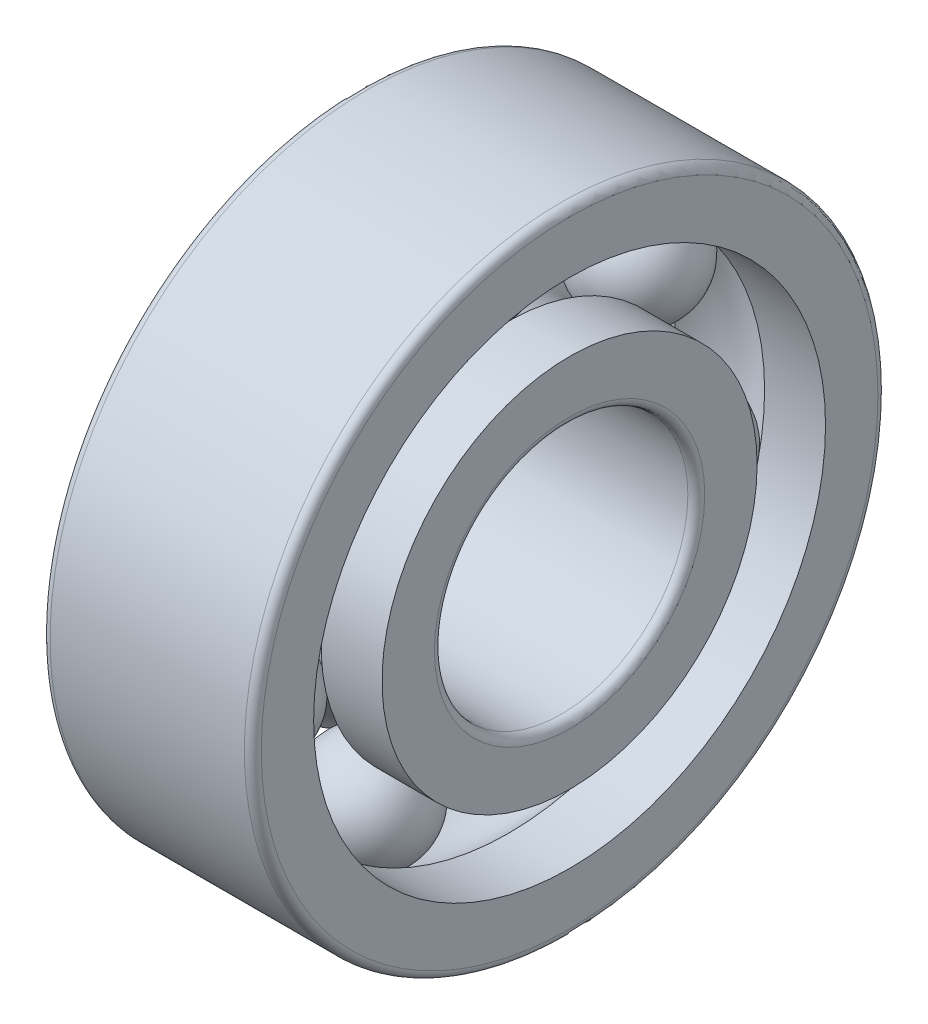
ISO-10303-21;
HEADER;
FILE_DESCRIPTION(('STEP AP214'),'2;1');
FILE_NAME('part.step','',(''),(''),'','','');
FILE_SCHEMA(('AUTOMOTIVE_DESIGN { 1 0 10303 214 1 1 1 1 }'));
ENDSEC;
DATA;
#1=APPLICATION_CONTEXT('core data for automotive mechanical design processes');
#2=APPLICATION_PROTOCOL_DEFINITION('international standard','automotive_design',2000,#1);
#3=PRODUCT_CONTEXT('',#1,'mechanical');
#4=PRODUCT('Part','Part','',(#3));
#5=PRODUCT_RELATED_PRODUCT_CATEGORY('part','',(#4));
#6=PRODUCT_DEFINITION_FORMATION('','',#4);
#7=PRODUCT_DEFINITION_CONTEXT('part definition',#1,'design');
#8=PRODUCT_DEFINITION('design','',#6,#7);
#9=PRODUCT_DEFINITION_SHAPE('','',#8);
#10=(LENGTH_UNIT() NAMED_UNIT(*) SI_UNIT(.MILLI.,.METRE.));
#11=(NAMED_UNIT(*) PLANE_ANGLE_UNIT() SI_UNIT($,.RADIAN.));
#12=(NAMED_UNIT(*) SI_UNIT($,.STERADIAN.) SOLID_ANGLE_UNIT());
#13=UNCERTAINTY_MEASURE_WITH_UNIT(LENGTH_MEASURE(1.E-05),#10,'distance_accuracy_value','');
#14=(GEOMETRIC_REPRESENTATION_CONTEXT(3) GLOBAL_UNCERTAINTY_ASSIGNED_CONTEXT((#13)) GLOBAL_UNIT_ASSIGNED_CONTEXT((#10,
#11,#12)) REPRESENTATION_CONTEXT('',''));
#15=CARTESIAN_POINT('',(0.,0.,0.));
#16=DIRECTION('',(0.,0.,1.));
#17=DIRECTION('',(1.,0.,0.));
#18=AXIS2_PLACEMENT_3D('',#15,#16,#17);
#19=CARTESIAN_POINT('',(2.5,-4.730086556488,2.277889630367));
#20=DIRECTION('',(-1.,0.,0.));
#21=DIRECTION('',(0.,-1.,0.));
#22=AXIS2_PLACEMENT_3D('',#19,#20,#21);
#23=SPHERICAL_SURFACE('',#22,1.332);
#24=CARTESIAN_POINT('',(1.168,-4.730086556488,2.277889630367));
#25=VERTEX_POINT('',#24);
#26=VERTEX_LOOP('',#25);
#27=FACE_BOUND('',#26,.T.);
#28=CARTESIAN_POINT('',(3.832,-4.730086556488,2.277889630367));
#29=VERTEX_POINT('',#28);
#30=VERTEX_LOOP('',#29);
#31=FACE_BOUND('',#30,.T.);
#32=ADVANCED_FACE('P0_F15',(#27,#31),#23,.T.);
#33=CLOSED_SHELL('',(#32));
#34=MANIFOLD_SOLID_BREP('P0_B1',#33);
#35=CARTESIAN_POINT('',(2.5,-4.730086556488,-2.277889630367));
#36=DIRECTION('',(-1.,0.,0.));
#37=DIRECTION('',(0.,-1.,0.));
#38=AXIS2_PLACEMENT_3D('',#35,#36,#37);
#39=SPHERICAL_SURFACE('',#38,1.332);
#40=CARTESIAN_POINT('',(1.168,-4.730086556488,-2.277889630367));
#41=VERTEX_POINT('',#40);
#42=VERTEX_LOOP('',#41);
#43=FACE_BOUND('',#42,.T.);
#44=CARTESIAN_POINT('',(3.832,-4.730086556488,-2.277889630367));
#45=VERTEX_POINT('',#44);
#46=VERTEX_LOOP('',#45);
#47=FACE_BOUND('',#46,.T.);
#48=ADVANCED_FACE('P1_F15',(#43,#47),#39,.T.);
#49=CLOSED_SHELL('',(#48));
#50=MANIFOLD_SOLID_BREP('P1_B1',#49);
#51=CARTESIAN_POINT('',(2.5,5.25,0.));
#52=DIRECTION('',(-1.,0.,0.));
#53=DIRECTION('',(0.,-1.,0.));
#54=AXIS2_PLACEMENT_3D('',#51,#52,#53);
#55=SPHERICAL_SURFACE('',#54,1.332);
#56=CARTESIAN_POINT('',(1.168,5.25,0.));
#57=VERTEX_POINT('',#56);
#58=VERTEX_LOOP('',#57);
#59=FACE_BOUND('',#58,.T.);
#60=CARTESIAN_POINT('',(3.832,5.25,0.));
#61=VERTEX_POINT('',#60);
#62=VERTEX_LOOP('',#61);
#63=FACE_BOUND('',#62,.T.);
#64=ADVANCED_FACE('P2_F15',(#59,#63),#55,.T.);
#65=CLOSED_SHELL('',(#64));
#66=MANIFOLD_SOLID_BREP('P2_B1',#65);
#67=CARTESIAN_POINT('',(2.5,3.273321459758,4.104615282957));
#68=DIRECTION('',(-1.,0.,0.));
#69=DIRECTION('',(0.,-1.,0.));
#70=AXIS2_PLACEMENT_3D('',#67,#68,#69);
#71=SPHERICAL_SURFACE('',#70,1.332);
#72=CARTESIAN_POINT('',(1.168,3.273321459758,4.104615282957));
#73=VERTEX_POINT('',#72);
#74=VERTEX_LOOP('',#73);
#75=FACE_BOUND('',#74,.T.);
#76=CARTESIAN_POINT('',(3.832,3.273321459758,4.104615282957));
#77=VERTEX_POINT('',#76);
#78=VERTEX_LOOP('',#77);
#79=FACE_BOUND('',#78,.T.);
#80=ADVANCED_FACE('P3_F15',(#75,#79),#71,.T.);
#81=CLOSED_SHELL('',(#80));
#82=MANIFOLD_SOLID_BREP('P3_B1',#81);
#83=CARTESIAN_POINT('',(0.2,0.,0.));
#84=DIRECTION('',(1.,0.,0.));
#85=DIRECTION('',(0.,0.,-1.));
#86=AXIS2_PLACEMENT_3D('',#83,#84,#85);
#87=TOROIDAL_SURFACE('',#86,7.3,0.2);
#88=CARTESIAN_POINT('',(0.2,0.,0.));
#89=DIRECTION('',(1.,0.,0.));
#90=DIRECTION('',(0.,0.,-1.));
#91=AXIS2_PLACEMENT_3D('',#88,#89,#90);
#92=CIRCLE('',#91,7.5);
#93=CARTESIAN_POINT('',(0.2,0.,-7.5));
#94=VERTEX_POINT('',#93);
#95=EDGE_CURVE('P4_E40',#94,#94,#92,.T.);
#96=ORIENTED_EDGE('',*,*,#95,.F.);
#97=EDGE_LOOP('',(#96));
#98=FACE_BOUND('',#97,.T.);
#99=CARTESIAN_POINT('',(0.,0.,0.));
#100=DIRECTION('',(1.,0.,0.));
#101=DIRECTION('',(0.,0.,-1.));
#102=AXIS2_PLACEMENT_3D('',#99,#100,#101);
#103=CIRCLE('',#102,7.3);
#104=CARTESIAN_POINT('',(0.,0.,-7.3));
#105=VERTEX_POINT('',#104);
#106=EDGE_CURVE('P4_E11',#105,#105,#103,.T.);
#107=ORIENTED_EDGE('',*,*,#106,.T.);
#108=EDGE_LOOP('',(#107));
#109=FACE_BOUND('',#108,.T.);
#110=ADVANCED_FACE('P4_F17',(#98,#109),#87,.T.);
#111=CARTESIAN_POINT('',(0.,7.3,0.));
#112=DIRECTION('',(-1.,0.,0.));
#113=DIRECTION('',(0.,0.,1.));
#114=AXIS2_PLACEMENT_3D('',#111,#112,#113);
#115=PLANE('',#114);
#116=ORIENTED_EDGE('',*,*,#106,.F.);
#117=EDGE_LOOP('',(#116));
#118=FACE_BOUND('',#117,.T.);
#119=CARTESIAN_POINT('',(0.,0.,0.));
#120=DIRECTION('',(1.,0.,0.));
#121=DIRECTION('',(0.,0.,-1.));
#122=AXIS2_PLACEMENT_3D('',#119,#120,#121);
#123=CIRCLE('',#122,6.06);
#124=CARTESIAN_POINT('',(0.,0.,-6.06));
#125=VERTEX_POINT('',#124);
#126=EDGE_CURVE('P4_E28',#125,#125,#123,.T.);
#127=ORIENTED_EDGE('',*,*,#126,.T.);
#128=EDGE_LOOP('',(#127));
#129=FACE_BOUND('',#128,.T.);
#130=ADVANCED_FACE('P4_F102',(#118,#129),#115,.T.);
#131=CARTESIAN_POINT('',(5.,0.,0.));
#132=DIRECTION('',(-1.,0.,0.));
#133=DIRECTION('',(0.,0.,-1.));
#134=AXIS2_PLACEMENT_3D('',#131,#132,#133);
#135=CYLINDRICAL_SURFACE('',#134,6.06);
#136=ORIENTED_EDGE('',*,*,#126,.F.);
#137=EDGE_LOOP('',(#136));
#138=FACE_BOUND('',#137,.T.);
#139=CARTESIAN_POINT('',(1.44258617372383,0.,0.));
#140=DIRECTION('',(1.,0.,0.));
#141=DIRECTION('',(0.,0.,-1.));
#142=AXIS2_PLACEMENT_3D('',#139,#140,#141);
#143=CIRCLE('',#142,6.06);
#144=CARTESIAN_POINT('',(1.44258617372383,0.,-6.06));
#145=VERTEX_POINT('',#144);
#146=EDGE_CURVE('P4_E192',#145,#145,#143,.T.);
#147=ORIENTED_EDGE('',*,*,#146,.T.);
#148=EDGE_LOOP('',(#147));
#149=FACE_BOUND('',#148,.T.);
#150=ADVANCED_FACE('P4_F19',(#138,#149),#135,.F.);
#151=CARTESIAN_POINT('',(2.5,0.,0.));
#152=DIRECTION('',(1.,0.,0.));
#153=DIRECTION('',(0.,0.,-1.));
#154=AXIS2_PLACEMENT_3D('',#151,#152,#153);
#155=TOROIDAL_SURFACE('',#154,5.25,1.332);
#156=CARTESIAN_POINT('',(3.55741382627617,0.,0.));
#157=DIRECTION('',(1.,0.,0.));
#158=DIRECTION('',(0.,0.,-1.));
#159=AXIS2_PLACEMENT_3D('',#156,#157,#158);
#160=CIRCLE('',#159,6.06);
#161=CARTESIAN_POINT('',(3.55741382627617,0.,-6.06));
#162=VERTEX_POINT('',#161);
#163=EDGE_CURVE('P4_E21',#162,#162,#160,.T.);
#164=ORIENTED_EDGE('',*,*,#163,.T.);
#165=EDGE_LOOP('',(#164));
#166=FACE_BOUND('',#165,.T.);
#167=ORIENTED_EDGE('',*,*,#146,.F.);
#168=EDGE_LOOP('',(#167));
#169=FACE_BOUND('',#168,.T.);
#170=CARTESIAN_POINT('',(2.5,0.,-6.582));
#171=VERTEX_POINT('',#170);
#172=VERTEX_LOOP('',#171);
#173=FACE_BOUND('',#172,.T.);
#174=ADVANCED_FACE('P4_F114',(#166,#169,#173),#155,.F.);
#175=CARTESIAN_POINT('',(5.,0.,0.));
#176=DIRECTION('',(-1.,0.,0.));
#177=DIRECTION('',(0.,0.,-1.));
#178=AXIS2_PLACEMENT_3D('',#175,#176,#177);
#179=CYLINDRICAL_SURFACE('',#178,6.06);
#180=ORIENTED_EDGE('',*,*,#163,.F.);
#181=EDGE_LOOP('',(#180));
#182=FACE_BOUND('',#181,.T.);
#183=CARTESIAN_POINT('',(5.,0.,0.));
#184=DIRECTION('',(1.,0.,0.));
#185=DIRECTION('',(0.,0.,-1.));
#186=AXIS2_PLACEMENT_3D('',#183,#184,#185);
#187=CIRCLE('',#186,6.06);
#188=CARTESIAN_POINT('',(5.,0.,-6.06));
#189=VERTEX_POINT('',#188);
#190=EDGE_CURVE('P4_E79',#189,#189,#187,.T.);
#191=ORIENTED_EDGE('',*,*,#190,.T.);
#192=EDGE_LOOP('',(#191));
#193=FACE_BOUND('',#192,.T.);
#194=ADVANCED_FACE('P4_F111',(#182,#193),#179,.F.);
#195=CARTESIAN_POINT('',(5.,6.06,0.));
#196=DIRECTION('',(1.,0.,0.));
#197=DIRECTION('',(0.,1.,0.));
#198=AXIS2_PLACEMENT_3D('',#195,#196,#197);
#199=PLANE('',#198);
#200=CARTESIAN_POINT('',(5.,0.,0.));
#201=DIRECTION('',(1.,0.,0.));
#202=DIRECTION('',(0.,0.,-1.));
#203=AXIS2_PLACEMENT_3D('',#200,#201,#202);
#204=CIRCLE('',#203,7.3);
#205=CARTESIAN_POINT('',(5.,0.,-7.3));
#206=VERTEX_POINT('',#205);
#207=EDGE_CURVE('P4_E74',#206,#206,#204,.T.);
#208=ORIENTED_EDGE('',*,*,#207,.T.);
#209=EDGE_LOOP('',(#208));
#210=FACE_BOUND('',#209,.T.);
#211=ORIENTED_EDGE('',*,*,#190,.F.);
#212=EDGE_LOOP('',(#211));
#213=FACE_BOUND('',#212,.T.);
#214=ADVANCED_FACE('P4_F98',(#210,#213),#199,.T.);
#215=CARTESIAN_POINT('',(4.8,0.,0.));
#216=DIRECTION('',(1.,0.,0.));
#217=DIRECTION('',(0.,0.,-1.));
#218=AXIS2_PLACEMENT_3D('',#215,#216,#217);
#219=TOROIDAL_SURFACE('',#218,7.3,0.2);
#220=ORIENTED_EDGE('',*,*,#207,.F.);
#221=EDGE_LOOP('',(#220));
#222=FACE_BOUND('',#221,.T.);
#223=CARTESIAN_POINT('',(4.8,0.,0.));
#224=DIRECTION('',(1.,0.,0.));
#225=DIRECTION('',(0.,0.,-1.));
#226=AXIS2_PLACEMENT_3D('',#223,#224,#225);
#227=CIRCLE('',#226,7.5);
#228=CARTESIAN_POINT('',(4.8,0.,-7.5));
#229=VERTEX_POINT('',#228);
#230=EDGE_CURVE('P4_E68',#229,#229,#227,.T.);
#231=ORIENTED_EDGE('',*,*,#230,.T.);
#232=EDGE_LOOP('',(#231));
#233=FACE_BOUND('',#232,.T.);
#234=ADVANCED_FACE('P4_F75',(#222,#233),#219,.T.);
#235=CARTESIAN_POINT('',(5.,0.,0.));
#236=DIRECTION('',(-1.,0.,0.));
#237=DIRECTION('',(0.,0.,-1.));
#238=AXIS2_PLACEMENT_3D('',#235,#236,#237);
#239=CYLINDRICAL_SURFACE('',#238,7.5);
#240=ORIENTED_EDGE('',*,*,#230,.F.);
#241=EDGE_LOOP('',(#240));
#242=FACE_BOUND('',#241,.T.);
#243=ORIENTED_EDGE('',*,*,#95,.T.);
#244=EDGE_LOOP('',(#243));
#245=FACE_BOUND('',#244,.T.);
#246=ADVANCED_FACE('P4_F91',(#242,#245),#239,.T.);
#247=CLOSED_SHELL('',(#110,#130,#150,#174,#194,#214,#234,#246));
#248=MANIFOLD_SOLID_BREP('P4_B1',#247);
#249=CARTESIAN_POINT('',(2.5,-1.168234903271,5.118371538955));
#250=DIRECTION('',(-1.,0.,0.));
#251=DIRECTION('',(0.,-1.,0.));
#252=AXIS2_PLACEMENT_3D('',#249,#250,#251);
#253=SPHERICAL_SURFACE('',#252,1.332);
#254=CARTESIAN_POINT('',(1.168,-1.168234903271,5.118371538955));
#255=VERTEX_POINT('',#254);
#256=VERTEX_LOOP('',#255);
#257=FACE_BOUND('',#256,.T.);
#258=CARTESIAN_POINT('',(3.832,-1.168234903271,5.118371538955));
#259=VERTEX_POINT('',#258);
#260=VERTEX_LOOP('',#259);
#261=FACE_BOUND('',#260,.T.);
#262=ADVANCED_FACE('P5_F15',(#257,#261),#253,.T.);
#263=CLOSED_SHELL('',(#262));
#264=MANIFOLD_SOLID_BREP('P5_B1',#263);
#265=CARTESIAN_POINT('',(0.,4.44,0.));
#266=DIRECTION('',(-1.,0.,0.));
#267=DIRECTION('',(0.,0.,1.));
#268=AXIS2_PLACEMENT_3D('',#265,#266,#267);
#269=PLANE('',#268);
#270=CARTESIAN_POINT('',(0.,0.,0.));
#271=DIRECTION('',(1.,0.,0.));
#272=DIRECTION('',(0.,0.,-1.));
#273=AXIS2_PLACEMENT_3D('',#270,#271,#272);
#274=CIRCLE('',#273,4.44);
#275=CARTESIAN_POINT('',(0.,0.,-4.44));
#276=VERTEX_POINT('',#275);
#277=EDGE_CURVE('P6_E21',#276,#276,#274,.T.);
#278=ORIENTED_EDGE('',*,*,#277,.F.);
#279=EDGE_LOOP('',(#278));
#280=FACE_BOUND('',#279,.T.);
#281=CARTESIAN_POINT('',(0.,0.,0.));
#282=DIRECTION('',(1.,0.,0.));
#283=DIRECTION('',(0.,0.,-1.));
#284=AXIS2_PLACEMENT_3D('',#281,#282,#283);
#285=CIRCLE('',#284,3.2);
#286=CARTESIAN_POINT('',(0.,0.,-3.2));
#287=VERTEX_POINT('',#286);
#288=EDGE_CURVE('P6_E11',#287,#287,#285,.T.);
#289=ORIENTED_EDGE('',*,*,#288,.T.);
#290=EDGE_LOOP('',(#289));
#291=FACE_BOUND('',#290,.T.);
#292=ADVANCED_FACE('P6_F17',(#280,#291),#269,.T.);
#293=CARTESIAN_POINT('',(0.2,0.,0.));
#294=DIRECTION('',(1.,0.,0.));
#295=DIRECTION('',(0.,0.,-1.));
#296=AXIS2_PLACEMENT_3D('',#293,#294,#295);
#297=TOROIDAL_SURFACE('',#296,3.2,0.2);
#298=ORIENTED_EDGE('',*,*,#288,.F.);
#299=EDGE_LOOP('',(#298));
#300=FACE_BOUND('',#299,.T.);
#301=CARTESIAN_POINT('',(0.2,0.,0.));
#302=DIRECTION('',(1.,0.,0.));
#303=DIRECTION('',(0.,0.,-1.));
#304=AXIS2_PLACEMENT_3D('',#301,#302,#303);
#305=CIRCLE('',#304,3.);
#306=CARTESIAN_POINT('',(0.2,0.,-3.));
#307=VERTEX_POINT('',#306);
#308=EDGE_CURVE('P6_E28',#307,#307,#305,.T.);
#309=ORIENTED_EDGE('',*,*,#308,.T.);
#310=EDGE_LOOP('',(#309));
#311=FACE_BOUND('',#310,.T.);
#312=ADVANCED_FACE('P6_F120',(#300,#311),#297,.T.);
#313=CARTESIAN_POINT('',(5.,0.,0.));
#314=DIRECTION('',(-1.,0.,0.));
#315=DIRECTION('',(0.,0.,-1.));
#316=AXIS2_PLACEMENT_3D('',#313,#314,#315);
#317=CYLINDRICAL_SURFACE('',#316,3.);
#318=ORIENTED_EDGE('',*,*,#308,.F.);
#319=EDGE_LOOP('',(#318));
#320=FACE_BOUND('',#319,.T.);
#321=CARTESIAN_POINT('',(4.8,0.,0.));
#322=DIRECTION('',(1.,0.,0.));
#323=DIRECTION('',(0.,0.,-1.));
#324=AXIS2_PLACEMENT_3D('',#321,#322,#323);
#325=CIRCLE('',#324,3.);
#326=CARTESIAN_POINT('',(4.8,0.,-3.));
#327=VERTEX_POINT('',#326);
#328=EDGE_CURVE('P6_E81',#327,#327,#325,.T.);
#329=ORIENTED_EDGE('',*,*,#328,.T.);
#330=EDGE_LOOP('',(#329));
#331=FACE_BOUND('',#330,.T.);
#332=ADVANCED_FACE('P6_F125',(#320,#331),#317,.F.);
#333=CARTESIAN_POINT('',(4.8,0.,0.));
#334=DIRECTION('',(1.,0.,0.));
#335=DIRECTION('',(0.,0.,-1.));
#336=AXIS2_PLACEMENT_3D('',#333,#334,#335);
#337=TOROIDAL_SURFACE('',#336,3.2,0.2);
#338=ORIENTED_EDGE('',*,*,#328,.F.);
#339=EDGE_LOOP('',(#338));
#340=FACE_BOUND('',#339,.T.);
#341=CARTESIAN_POINT('',(5.,0.,0.));
#342=DIRECTION('',(1.,0.,0.));
#343=DIRECTION('',(0.,0.,-1.));
#344=AXIS2_PLACEMENT_3D('',#341,#342,#343);
#345=CIRCLE('',#344,3.2);
#346=CARTESIAN_POINT('',(5.,0.,-3.2));
#347=VERTEX_POINT('',#346);
#348=EDGE_CURVE('P6_E85',#347,#347,#345,.T.);
#349=ORIENTED_EDGE('',*,*,#348,.T.);
#350=EDGE_LOOP('',(#349));
#351=FACE_BOUND('',#350,.T.);
#352=ADVANCED_FACE('P6_F19',(#340,#351),#337,.T.);
#353=CARTESIAN_POINT('',(5.,3.2,0.));
#354=DIRECTION('',(1.,0.,0.));
#355=DIRECTION('',(0.,1.,0.));
#356=AXIS2_PLACEMENT_3D('',#353,#354,#355);
#357=PLANE('',#356);
#358=CARTESIAN_POINT('',(5.,0.,0.));
#359=DIRECTION('',(1.,0.,0.));
#360=DIRECTION('',(0.,0.,-1.));
#361=AXIS2_PLACEMENT_3D('',#358,#359,#360);
#362=CIRCLE('',#361,4.44);
#363=CARTESIAN_POINT('',(5.,0.,-4.44));
#364=VERTEX_POINT('',#363);
#365=EDGE_CURVE('P6_E69',#364,#364,#362,.T.);
#366=ORIENTED_EDGE('',*,*,#365,.T.);
#367=EDGE_LOOP('',(#366));
#368=FACE_BOUND('',#367,.T.);
#369=ORIENTED_EDGE('',*,*,#348,.F.);
#370=EDGE_LOOP('',(#369));
#371=FACE_BOUND('',#370,.T.);
#372=ADVANCED_FACE('P6_F136',(#368,#371),#357,.T.);
#373=CARTESIAN_POINT('',(5.,0.,0.));
#374=DIRECTION('',(-1.,0.,0.));
#375=DIRECTION('',(0.,0.,-1.));
#376=AXIS2_PLACEMENT_3D('',#373,#374,#375);
#377=CYLINDRICAL_SURFACE('',#376,4.44);
#378=ORIENTED_EDGE('',*,*,#365,.F.);
#379=EDGE_LOOP('',(#378));
#380=FACE_BOUND('',#379,.T.);
#381=CARTESIAN_POINT('',(3.55741382627617,0.,0.));
#382=DIRECTION('',(1.,0.,0.));
#383=DIRECTION('',(0.,0.,-1.));
#384=AXIS2_PLACEMENT_3D('',#381,#382,#383);
#385=CIRCLE('',#384,4.44);
#386=CARTESIAN_POINT('',(3.55741382627617,0.,-4.44));
#387=VERTEX_POINT('',#386);
#388=EDGE_CURVE('P6_E63',#387,#387,#385,.T.);
#389=ORIENTED_EDGE('',*,*,#388,.T.);
#390=EDGE_LOOP('',(#389));
#391=FACE_BOUND('',#390,.T.);
#392=ADVANCED_FACE('P6_F116',(#380,#391),#377,.T.);
#393=CARTESIAN_POINT('',(2.5,0.,0.));
#394=DIRECTION('',(1.,0.,0.));
#395=DIRECTION('',(0.,0.,-1.));
#396=AXIS2_PLACEMENT_3D('',#393,#394,#395);
#397=TOROIDAL_SURFACE('',#396,5.25,1.332);
#398=CARTESIAN_POINT('',(1.44258617372383,0.,0.));
#399=DIRECTION('',(1.,0.,0.));
#400=DIRECTION('',(0.,0.,-1.));
#401=AXIS2_PLACEMENT_3D('',#398,#399,#400);
#402=CIRCLE('',#401,4.44);
#403=CARTESIAN_POINT('',(1.44258617372383,0.,-4.44));
#404=VERTEX_POINT('',#403);
#405=EDGE_CURVE('P6_E57',#404,#404,#402,.T.);
#406=ORIENTED_EDGE('',*,*,#405,.T.);
#407=EDGE_LOOP('',(#406));
#408=FACE_BOUND('',#407,.T.);
#409=ORIENTED_EDGE('',*,*,#388,.F.);
#410=EDGE_LOOP('',(#409));
#411=FACE_BOUND('',#410,.T.);
#412=ADVANCED_FACE('P6_F109',(#408,#411),#397,.F.);
#413=CARTESIAN_POINT('',(5.,0.,0.));
#414=DIRECTION('',(-1.,0.,0.));
#415=DIRECTION('',(0.,0.,-1.));
#416=AXIS2_PLACEMENT_3D('',#413,#414,#415);
#417=CYLINDRICAL_SURFACE('',#416,4.44);
#418=ORIENTED_EDGE('',*,*,#405,.F.);
#419=EDGE_LOOP('',(#418));
#420=FACE_BOUND('',#419,.T.);
#421=ORIENTED_EDGE('',*,*,#277,.T.);
#422=EDGE_LOOP('',(#421));
#423=FACE_BOUND('',#422,.T.);
#424=ADVANCED_FACE('P6_F107',(#420,#423),#417,.T.);
#425=CLOSED_SHELL('',(#292,#312,#332,#352,#372,#392,#412,#424));
#426=MANIFOLD_SOLID_BREP('P6_B1',#425);
#427=CARTESIAN_POINT('',(2.5,3.273321459758,-4.104615282957));
#428=DIRECTION('',(-1.,0.,0.));
#429=DIRECTION('',(0.,-1.,0.));
#430=AXIS2_PLACEMENT_3D('',#427,#428,#429);
#431=SPHERICAL_SURFACE('',#430,1.332);
#432=CARTESIAN_POINT('',(1.168,3.273321459758,-4.104615282957));
#433=VERTEX_POINT('',#432);
#434=VERTEX_LOOP('',#433);
#435=FACE_BOUND('',#434,.T.);
#436=CARTESIAN_POINT('',(3.832,3.273321459758,-4.104615282957));
#437=VERTEX_POINT('',#436);
#438=VERTEX_LOOP('',#437);
#439=FACE_BOUND('',#438,.T.);
#440=ADVANCED_FACE('P7_F14',(#435,#439),#431,.T.);
#441=CLOSED_SHELL('',(#440));
#442=MANIFOLD_SOLID_BREP('P7_B1',#441);
#443=CARTESIAN_POINT('',(2.5,-1.168234903271,-5.118371538955));
#444=DIRECTION('',(-1.,0.,0.));
#445=DIRECTION('',(0.,-1.,0.));
#446=AXIS2_PLACEMENT_3D('',#443,#444,#445);
#447=SPHERICAL_SURFACE('',#446,1.332);
#448=CARTESIAN_POINT('',(1.168,-1.168234903271,-5.118371538955));
#449=VERTEX_POINT('',#448);
#450=VERTEX_LOOP('',#449);
#451=FACE_BOUND('',#450,.T.);
#452=CARTESIAN_POINT('',(3.832,-1.168234903271,-5.118371538955));
#453=VERTEX_POINT('',#452);
#454=VERTEX_LOOP('',#453);
#455=FACE_BOUND('',#454,.T.);
#456=ADVANCED_FACE('P8_F15',(#451,#455),#447,.T.);
#457=CLOSED_SHELL('',(#456));
#458=MANIFOLD_SOLID_BREP('P8_B1',#457);
#459=ADVANCED_BREP_SHAPE_REPRESENTATION('',(#18,#34,#50,#66,#82,#248,#264,#426,#442,#458),#14);
#460=SHAPE_DEFINITION_REPRESENTATION(#9,#459);
ENDSEC;
END-ISO-10303-21;
